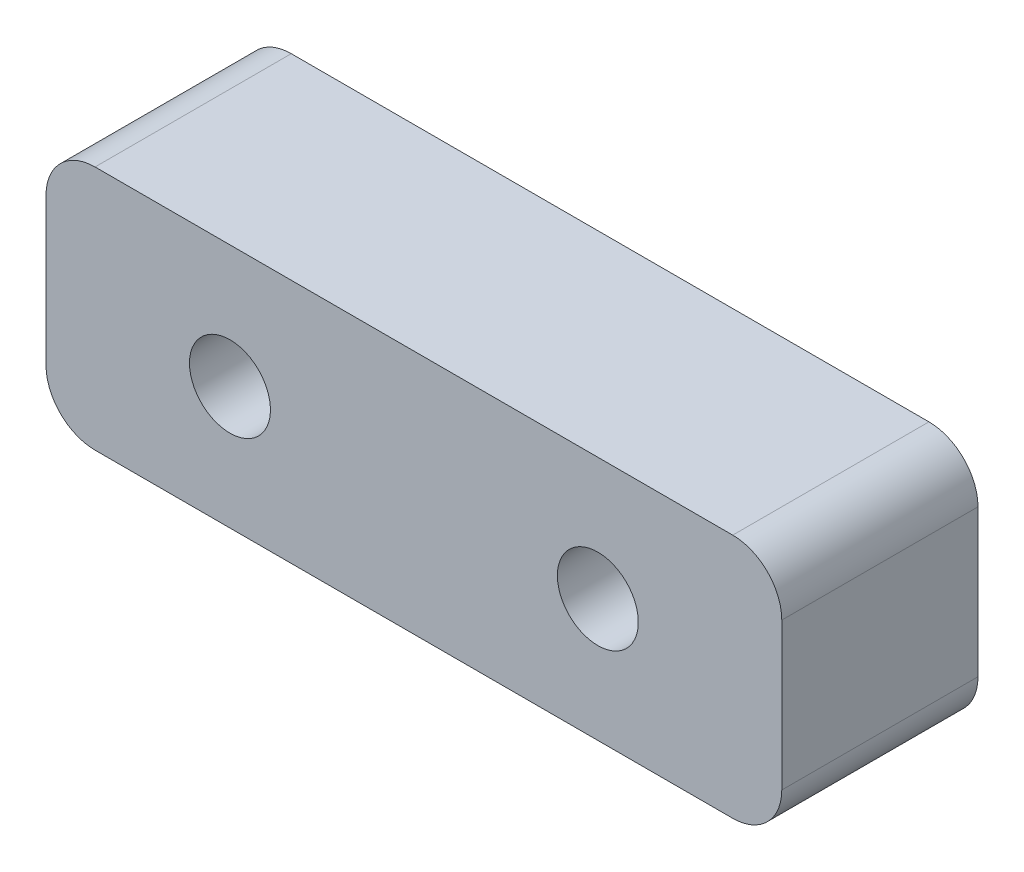
ISO-10303-21;
HEADER;
FILE_DESCRIPTION(('STEP AP214'),'2;1');
FILE_NAME('part.step','',(''),(''),'','','');
FILE_SCHEMA(('AUTOMOTIVE_DESIGN { 1 0 10303 214 1 1 1 1 }'));
ENDSEC;
DATA;
#1=APPLICATION_CONTEXT('core data for automotive mechanical design processes');
#2=APPLICATION_PROTOCOL_DEFINITION('international standard','automotive_design',2000,#1);
#3=PRODUCT_CONTEXT('',#1,'mechanical');
#4=PRODUCT('Part','Part','',(#3));
#5=PRODUCT_RELATED_PRODUCT_CATEGORY('part','',(#4));
#6=PRODUCT_DEFINITION_FORMATION('','',#4);
#7=PRODUCT_DEFINITION_CONTEXT('part definition',#1,'design');
#8=PRODUCT_DEFINITION('design','',#6,#7);
#9=PRODUCT_DEFINITION_SHAPE('','',#8);
#10=(LENGTH_UNIT() NAMED_UNIT(*) SI_UNIT(.MILLI.,.METRE.));
#11=(NAMED_UNIT(*) PLANE_ANGLE_UNIT() SI_UNIT($,.RADIAN.));
#12=(NAMED_UNIT(*) SI_UNIT($,.STERADIAN.) SOLID_ANGLE_UNIT());
#13=UNCERTAINTY_MEASURE_WITH_UNIT(LENGTH_MEASURE(1.E-05),#10,'distance_accuracy_value','');
#14=(GEOMETRIC_REPRESENTATION_CONTEXT(3) GLOBAL_UNCERTAINTY_ASSIGNED_CONTEXT((#13)) GLOBAL_UNIT_ASSIGNED_CONTEXT((#10,
#11,#12)) REPRESENTATION_CONTEXT('',''));
#15=CARTESIAN_POINT('',(0.,0.,0.));
#16=DIRECTION('',(0.,0.,1.));
#17=DIRECTION('',(1.,0.,0.));
#18=AXIS2_PLACEMENT_3D('',#15,#16,#17);
#19=CARTESIAN_POINT('',(15.,-5.,8.));
#20=DIRECTION('',(-1.,0.,0.));
#21=DIRECTION('',(0.,0.,1.));
#22=AXIS2_PLACEMENT_3D('',#19,#20,#21);
#23=PLANE('',#22);
#24=DIRECTION('',(0.,1.,0.));
#25=VECTOR('',#24,1.);
#26=CARTESIAN_POINT('',(15.,-5.,8.));
#27=LINE('',#26,#25);
#28=CARTESIAN_POINT('',(15.,-3.,8.));
#29=VERTEX_POINT('',#28);
#30=CARTESIAN_POINT('',(15.,3.,8.));
#31=VERTEX_POINT('',#30);
#32=EDGE_CURVE('E125',#29,#31,#27,.T.);
#33=ORIENTED_EDGE('',*,*,#32,.F.);
#34=DIRECTION('',(0.,0.,-1.));
#35=VECTOR('',#34,1.);
#36=CARTESIAN_POINT('',(15.,-3.,8.));
#37=LINE('',#36,#35);
#38=CARTESIAN_POINT('',(15.,-3.,0.));
#39=VERTEX_POINT('',#38);
#40=EDGE_CURVE('E110',#29,#39,#37,.T.);
#41=ORIENTED_EDGE('',*,*,#40,.T.);
#42=DIRECTION('',(0.,1.,0.));
#43=VECTOR('',#42,1.);
#44=CARTESIAN_POINT('',(15.,-5.,0.));
#45=LINE('',#44,#43);
#46=CARTESIAN_POINT('',(15.,3.,0.));
#47=VERTEX_POINT('',#46);
#48=EDGE_CURVE('E122',#39,#47,#45,.T.);
#49=ORIENTED_EDGE('',*,*,#48,.T.);
#50=DIRECTION('',(0.,0.,-1.));
#51=VECTOR('',#50,1.);
#52=CARTESIAN_POINT('',(15.,3.,8.));
#53=LINE('',#52,#51);
#54=EDGE_CURVE('E127',#47,#31,#53,.F.);
#55=ORIENTED_EDGE('',*,*,#54,.T.);
#56=EDGE_LOOP('',(#33,#41,#49,#55));
#57=FACE_BOUND('',#56,.T.);
#58=ADVANCED_FACE('F39',(#57),#23,.F.);
#59=CARTESIAN_POINT('',(-15.,5.,8.));
#60=DIRECTION('',(0.,-1.,0.));
#61=DIRECTION('',(0.,0.,-1.));
#62=AXIS2_PLACEMENT_3D('',#59,#60,#61);
#63=PLANE('',#62);
#64=DIRECTION('',(-1.,0.,0.));
#65=VECTOR('',#64,1.);
#66=CARTESIAN_POINT('',(-15.,5.,8.));
#67=LINE('',#66,#65);
#68=CARTESIAN_POINT('',(13.,5.,8.));
#69=VERTEX_POINT('',#68);
#70=CARTESIAN_POINT('',(-13.,5.,8.));
#71=VERTEX_POINT('',#70);
#72=EDGE_CURVE('E176',#69,#71,#67,.T.);
#73=ORIENTED_EDGE('',*,*,#72,.F.);
#74=DIRECTION('',(0.,0.,-1.));
#75=VECTOR('',#74,1.);
#76=CARTESIAN_POINT('',(13.,5.,8.));
#77=LINE('',#76,#75);
#78=CARTESIAN_POINT('',(13.,5.,0.));
#79=VERTEX_POINT('',#78);
#80=EDGE_CURVE('E12',#69,#79,#77,.T.);
#81=ORIENTED_EDGE('',*,*,#80,.T.);
#82=DIRECTION('',(-1.,0.,0.));
#83=VECTOR('',#82,1.);
#84=CARTESIAN_POINT('',(-15.,5.,0.));
#85=LINE('',#84,#83);
#86=CARTESIAN_POINT('',(-13.,5.,0.));
#87=VERTEX_POINT('',#86);
#88=EDGE_CURVE('E132',#79,#87,#85,.T.);
#89=ORIENTED_EDGE('',*,*,#88,.T.);
#90=DIRECTION('',(0.,0.,-1.));
#91=VECTOR('',#90,1.);
#92=CARTESIAN_POINT('',(-13.,5.,8.));
#93=LINE('',#92,#91);
#94=EDGE_CURVE('E47',#87,#71,#93,.F.);
#95=ORIENTED_EDGE('',*,*,#94,.T.);
#96=EDGE_LOOP('',(#73,#81,#89,#95));
#97=FACE_BOUND('',#96,.T.);
#98=ADVANCED_FACE('F175',(#97),#63,.F.);
#99=CARTESIAN_POINT('',(-15.,-5.,8.));
#100=DIRECTION('',(1.,0.,0.));
#101=DIRECTION('',(0.,0.,-1.));
#102=AXIS2_PLACEMENT_3D('',#99,#100,#101);
#103=PLANE('',#102);
#104=DIRECTION('',(0.,-1.,0.));
#105=VECTOR('',#104,1.);
#106=CARTESIAN_POINT('',(-15.,-5.,0.));
#107=LINE('',#106,#105);
#108=CARTESIAN_POINT('',(-15.,3.,0.));
#109=VERTEX_POINT('',#108);
#110=CARTESIAN_POINT('',(-15.,-3.,0.));
#111=VERTEX_POINT('',#110);
#112=EDGE_CURVE('E136',#109,#111,#107,.T.);
#113=ORIENTED_EDGE('',*,*,#112,.T.);
#114=DIRECTION('',(0.,0.,-1.));
#115=VECTOR('',#114,1.);
#116=CARTESIAN_POINT('',(-15.,-3.,8.));
#117=LINE('',#116,#115);
#118=CARTESIAN_POINT('',(-15.,-3.,8.));
#119=VERTEX_POINT('',#118);
#120=EDGE_CURVE('E54',#111,#119,#117,.F.);
#121=ORIENTED_EDGE('',*,*,#120,.T.);
#122=DIRECTION('',(0.,-1.,0.));
#123=VECTOR('',#122,1.);
#124=CARTESIAN_POINT('',(-15.,-5.,8.));
#125=LINE('',#124,#123);
#126=CARTESIAN_POINT('',(-15.,3.,8.));
#127=VERTEX_POINT('',#126);
#128=EDGE_CURVE('E182',#127,#119,#125,.T.);
#129=ORIENTED_EDGE('',*,*,#128,.F.);
#130=DIRECTION('',(0.,0.,-1.));
#131=VECTOR('',#130,1.);
#132=CARTESIAN_POINT('',(-15.,3.,8.));
#133=LINE('',#132,#131);
#134=EDGE_CURVE('E169',#127,#109,#133,.T.);
#135=ORIENTED_EDGE('',*,*,#134,.T.);
#136=EDGE_LOOP('',(#113,#121,#129,#135));
#137=FACE_BOUND('',#136,.T.);
#138=ADVANCED_FACE('F186',(#137),#103,.F.);
#139=CARTESIAN_POINT('',(-15.,-5.,8.));
#140=DIRECTION('',(0.,1.,0.));
#141=DIRECTION('',(0.,0.,1.));
#142=AXIS2_PLACEMENT_3D('',#139,#140,#141);
#143=PLANE('',#142);
#144=DIRECTION('',(1.,0.,0.));
#145=VECTOR('',#144,1.);
#146=CARTESIAN_POINT('',(-15.,-5.,0.));
#147=LINE('',#146,#145);
#148=CARTESIAN_POINT('',(-13.,-5.,0.));
#149=VERTEX_POINT('',#148);
#150=CARTESIAN_POINT('',(13.,-5.,0.));
#151=VERTEX_POINT('',#150);
#152=EDGE_CURVE('E187',#149,#151,#147,.T.);
#153=ORIENTED_EDGE('',*,*,#152,.T.);
#154=DIRECTION('',(0.,0.,-1.));
#155=VECTOR('',#154,1.);
#156=CARTESIAN_POINT('',(13.,-5.,8.));
#157=LINE('',#156,#155);
#158=CARTESIAN_POINT('',(13.,-5.,8.));
#159=VERTEX_POINT('',#158);
#160=EDGE_CURVE('E111',#151,#159,#157,.F.);
#161=ORIENTED_EDGE('',*,*,#160,.T.);
#162=DIRECTION('',(1.,0.,0.));
#163=VECTOR('',#162,1.);
#164=CARTESIAN_POINT('',(-15.,-5.,8.));
#165=LINE('',#164,#163);
#166=CARTESIAN_POINT('',(-13.,-5.,8.));
#167=VERTEX_POINT('',#166);
#168=EDGE_CURVE('E143',#167,#159,#165,.T.);
#169=ORIENTED_EDGE('',*,*,#168,.F.);
#170=DIRECTION('',(0.,0.,-1.));
#171=VECTOR('',#170,1.);
#172=CARTESIAN_POINT('',(-13.,-5.,8.));
#173=LINE('',#172,#171);
#174=EDGE_CURVE('E116',#167,#149,#173,.T.);
#175=ORIENTED_EDGE('',*,*,#174,.T.);
#176=EDGE_LOOP('',(#153,#161,#169,#175));
#177=FACE_BOUND('',#176,.T.);
#178=ADVANCED_FACE('F263',(#177),#143,.F.);
#179=CARTESIAN_POINT('',(0.,0.,8.));
#180=DIRECTION('',(0.,0.,-1.));
#181=DIRECTION('',(-1.,0.,0.));
#182=AXIS2_PLACEMENT_3D('',#179,#180,#181);
#183=PLANE('',#182);
#184=CARTESIAN_POINT('',(7.5,0.,8.));
#185=DIRECTION('',(0.,0.,-1.));
#186=DIRECTION('',(-1.,0.,0.));
#187=AXIS2_PLACEMENT_3D('',#184,#185,#186);
#188=CIRCLE('',#187,1.65);
#189=CARTESIAN_POINT('',(5.85,0.,8.));
#190=VERTEX_POINT('',#189);
#191=EDGE_CURVE('E133',#190,#190,#188,.T.);
#192=ORIENTED_EDGE('',*,*,#191,.T.);
#193=EDGE_LOOP('',(#192));
#194=FACE_BOUND('',#193,.T.);
#195=CARTESIAN_POINT('',(-7.5,0.,8.));
#196=DIRECTION('',(0.,0.,-1.));
#197=DIRECTION('',(-1.,0.,0.));
#198=AXIS2_PLACEMENT_3D('',#195,#196,#197);
#199=CIRCLE('',#198,1.65);
#200=CARTESIAN_POINT('',(-9.15,0.,8.));
#201=VERTEX_POINT('',#200);
#202=EDGE_CURVE('E203',#201,#201,#199,.T.);
#203=ORIENTED_EDGE('',*,*,#202,.T.);
#204=EDGE_LOOP('',(#203));
#205=FACE_BOUND('',#204,.T.);
#206=ORIENTED_EDGE('',*,*,#168,.T.);
#207=CARTESIAN_POINT('',(13.,-3.,8.));
#208=DIRECTION('',(0.,0.,-1.));
#209=DIRECTION('',(-1.,0.,0.));
#210=AXIS2_PLACEMENT_3D('',#207,#208,#209);
#211=CIRCLE('',#210,2.);
#212=EDGE_CURVE('E167',#159,#29,#211,.F.);
#213=ORIENTED_EDGE('',*,*,#212,.T.);
#214=ORIENTED_EDGE('',*,*,#32,.T.);
#215=CARTESIAN_POINT('',(13.,3.,8.));
#216=DIRECTION('',(0.,0.,-1.));
#217=DIRECTION('',(-1.,0.,0.));
#218=AXIS2_PLACEMENT_3D('',#215,#216,#217);
#219=CIRCLE('',#218,2.);
#220=EDGE_CURVE('E163',#31,#69,#219,.F.);
#221=ORIENTED_EDGE('',*,*,#220,.T.);
#222=ORIENTED_EDGE('',*,*,#72,.T.);
#223=CARTESIAN_POINT('',(-13.,3.,8.));
#224=DIRECTION('',(0.,0.,-1.));
#225=DIRECTION('',(-1.,0.,0.));
#226=AXIS2_PLACEMENT_3D('',#223,#224,#225);
#227=CIRCLE('',#226,2.);
#228=EDGE_CURVE('E61',#71,#127,#227,.F.);
#229=ORIENTED_EDGE('',*,*,#228,.T.);
#230=ORIENTED_EDGE('',*,*,#128,.T.);
#231=CARTESIAN_POINT('',(-13.,-3.,8.));
#232=DIRECTION('',(0.,0.,-1.));
#233=DIRECTION('',(-1.,0.,0.));
#234=AXIS2_PLACEMENT_3D('',#231,#232,#233);
#235=CIRCLE('',#234,2.);
#236=EDGE_CURVE('E165',#119,#167,#235,.F.);
#237=ORIENTED_EDGE('',*,*,#236,.T.);
#238=EDGE_LOOP('',(#206,#213,#214,#221,#222,#229,#230,#237));
#239=FACE_BOUND('',#238,.T.);
#240=ADVANCED_FACE('F180',(#194,#205,#239),#183,.F.);
#241=CARTESIAN_POINT('',(0.,0.,0.));
#242=DIRECTION('',(0.,0.,-1.));
#243=DIRECTION('',(-1.,0.,0.));
#244=AXIS2_PLACEMENT_3D('',#241,#242,#243);
#245=PLANE('',#244);
#246=CARTESIAN_POINT('',(7.5,0.,0.));
#247=DIRECTION('',(0.,0.,-1.));
#248=DIRECTION('',(-1.,0.,0.));
#249=AXIS2_PLACEMENT_3D('',#246,#247,#248);
#250=CIRCLE('',#249,1.65);
#251=CARTESIAN_POINT('',(5.85,0.,0.));
#252=VERTEX_POINT('',#251);
#253=EDGE_CURVE('E139',#252,#252,#250,.T.);
#254=ORIENTED_EDGE('',*,*,#253,.F.);
#255=EDGE_LOOP('',(#254));
#256=FACE_BOUND('',#255,.T.);
#257=CARTESIAN_POINT('',(-7.5,0.,0.));
#258=DIRECTION('',(0.,0.,-1.));
#259=DIRECTION('',(-1.,0.,0.));
#260=AXIS2_PLACEMENT_3D('',#257,#258,#259);
#261=CIRCLE('',#260,1.65);
#262=CARTESIAN_POINT('',(-9.15,0.,0.));
#263=VERTEX_POINT('',#262);
#264=EDGE_CURVE('E199',#263,#263,#261,.T.);
#265=ORIENTED_EDGE('',*,*,#264,.F.);
#266=EDGE_LOOP('',(#265));
#267=FACE_BOUND('',#266,.T.);
#268=ORIENTED_EDGE('',*,*,#48,.F.);
#269=CARTESIAN_POINT('',(13.,-3.,0.));
#270=DIRECTION('',(0.,0.,-1.));
#271=DIRECTION('',(-1.,0.,0.));
#272=AXIS2_PLACEMENT_3D('',#269,#270,#271);
#273=CIRCLE('',#272,2.);
#274=EDGE_CURVE('E106',#39,#151,#273,.T.);
#275=ORIENTED_EDGE('',*,*,#274,.T.);
#276=ORIENTED_EDGE('',*,*,#152,.F.);
#277=CARTESIAN_POINT('',(-13.,-3.,0.));
#278=DIRECTION('',(0.,0.,-1.));
#279=DIRECTION('',(-1.,0.,0.));
#280=AXIS2_PLACEMENT_3D('',#277,#278,#279);
#281=CIRCLE('',#280,2.);
#282=EDGE_CURVE('E117',#149,#111,#281,.T.);
#283=ORIENTED_EDGE('',*,*,#282,.T.);
#284=ORIENTED_EDGE('',*,*,#112,.F.);
#285=CARTESIAN_POINT('',(-13.,3.,0.));
#286=DIRECTION('',(0.,0.,-1.));
#287=DIRECTION('',(-1.,0.,0.));
#288=AXIS2_PLACEMENT_3D('',#285,#286,#287);
#289=CIRCLE('',#288,2.);
#290=EDGE_CURVE('E126',#109,#87,#289,.T.);
#291=ORIENTED_EDGE('',*,*,#290,.T.);
#292=ORIENTED_EDGE('',*,*,#88,.F.);
#293=CARTESIAN_POINT('',(13.,3.,0.));
#294=DIRECTION('',(0.,0.,-1.));
#295=DIRECTION('',(-1.,0.,0.));
#296=AXIS2_PLACEMENT_3D('',#293,#294,#295);
#297=CIRCLE('',#296,2.);
#298=EDGE_CURVE('E131',#79,#47,#297,.T.);
#299=ORIENTED_EDGE('',*,*,#298,.T.);
#300=EDGE_LOOP('',(#268,#275,#276,#283,#284,#291,#292,#299));
#301=FACE_BOUND('',#300,.T.);
#302=ADVANCED_FACE('F129',(#256,#267,#301),#245,.T.);
#303=CARTESIAN_POINT('',(13.,-3.,8.));
#304=DIRECTION('',(0.,0.,-1.));
#305=DIRECTION('',(-1.,0.,0.));
#306=AXIS2_PLACEMENT_3D('',#303,#304,#305);
#307=CYLINDRICAL_SURFACE('',#306,2.);
#308=ORIENTED_EDGE('',*,*,#212,.F.);
#309=ORIENTED_EDGE('',*,*,#160,.F.);
#310=ORIENTED_EDGE('',*,*,#274,.F.);
#311=ORIENTED_EDGE('',*,*,#40,.F.);
#312=EDGE_LOOP('',(#308,#309,#310,#311));
#313=FACE_BOUND('',#312,.T.);
#314=ADVANCED_FACE('F109',(#313),#307,.T.);
#315=CARTESIAN_POINT('',(-13.,-3.,8.));
#316=DIRECTION('',(0.,0.,-1.));
#317=DIRECTION('',(-1.,0.,0.));
#318=AXIS2_PLACEMENT_3D('',#315,#316,#317);
#319=CYLINDRICAL_SURFACE('',#318,2.);
#320=ORIENTED_EDGE('',*,*,#236,.F.);
#321=ORIENTED_EDGE('',*,*,#120,.F.);
#322=ORIENTED_EDGE('',*,*,#282,.F.);
#323=ORIENTED_EDGE('',*,*,#174,.F.);
#324=EDGE_LOOP('',(#320,#321,#322,#323));
#325=FACE_BOUND('',#324,.T.);
#326=ADVANCED_FACE('F240',(#325),#319,.T.);
#327=CARTESIAN_POINT('',(13.,3.,8.));
#328=DIRECTION('',(0.,0.,-1.));
#329=DIRECTION('',(-1.,0.,0.));
#330=AXIS2_PLACEMENT_3D('',#327,#328,#329);
#331=CYLINDRICAL_SURFACE('',#330,2.);
#332=ORIENTED_EDGE('',*,*,#220,.F.);
#333=ORIENTED_EDGE('',*,*,#54,.F.);
#334=ORIENTED_EDGE('',*,*,#298,.F.);
#335=ORIENTED_EDGE('',*,*,#80,.F.);
#336=EDGE_LOOP('',(#332,#333,#334,#335));
#337=FACE_BOUND('',#336,.T.);
#338=ADVANCED_FACE('F227',(#337),#331,.T.);
#339=CARTESIAN_POINT('',(-13.,3.,8.));
#340=DIRECTION('',(0.,0.,-1.));
#341=DIRECTION('',(-1.,0.,0.));
#342=AXIS2_PLACEMENT_3D('',#339,#340,#341);
#343=CYLINDRICAL_SURFACE('',#342,2.);
#344=ORIENTED_EDGE('',*,*,#228,.F.);
#345=ORIENTED_EDGE('',*,*,#94,.F.);
#346=ORIENTED_EDGE('',*,*,#290,.F.);
#347=ORIENTED_EDGE('',*,*,#134,.F.);
#348=EDGE_LOOP('',(#344,#345,#346,#347));
#349=FACE_BOUND('',#348,.T.);
#350=ADVANCED_FACE('F41',(#349),#343,.T.);
#351=CARTESIAN_POINT('',(-7.5,0.,8.));
#352=DIRECTION('',(0.,0.,-1.));
#353=DIRECTION('',(-1.,0.,0.));
#354=AXIS2_PLACEMENT_3D('',#351,#352,#353);
#355=CYLINDRICAL_SURFACE('',#354,1.65);
#356=ORIENTED_EDGE('',*,*,#202,.F.);
#357=EDGE_LOOP('',(#356));
#358=FACE_BOUND('',#357,.T.);
#359=ORIENTED_EDGE('',*,*,#264,.T.);
#360=EDGE_LOOP('',(#359));
#361=FACE_BOUND('',#360,.T.);
#362=ADVANCED_FACE('F217',(#358,#361),#355,.F.);
#363=CARTESIAN_POINT('',(7.5,0.,8.));
#364=DIRECTION('',(0.,0.,-1.));
#365=DIRECTION('',(-1.,0.,0.));
#366=AXIS2_PLACEMENT_3D('',#363,#364,#365);
#367=CYLINDRICAL_SURFACE('',#366,1.65);
#368=ORIENTED_EDGE('',*,*,#191,.F.);
#369=EDGE_LOOP('',(#368));
#370=FACE_BOUND('',#369,.T.);
#371=ORIENTED_EDGE('',*,*,#253,.T.);
#372=EDGE_LOOP('',(#371));
#373=FACE_BOUND('',#372,.T.);
#374=ADVANCED_FACE('F210',(#370,#373),#367,.F.);
#375=CLOSED_SHELL('',(#58,#98,#138,#178,#240,#302,#314,#326,#338,#350,#362,#374));
#376=MANIFOLD_SOLID_BREP('B2',#375);
#377=ADVANCED_BREP_SHAPE_REPRESENTATION('',(#18,#376),#14);
#378=SHAPE_DEFINITION_REPRESENTATION(#9,#377);
ENDSEC;
END-ISO-10303-21;
